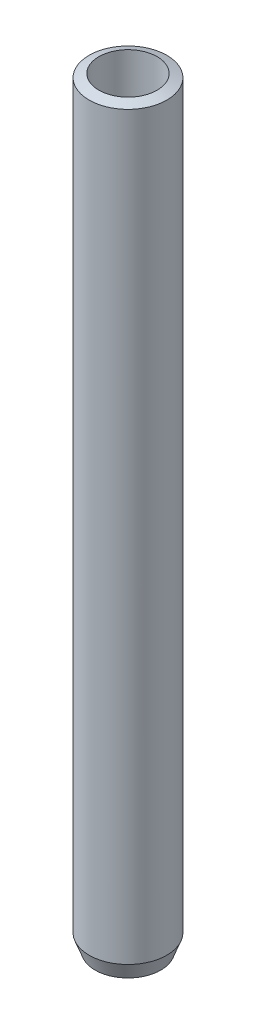
ISO-10303-21;
HEADER;
FILE_DESCRIPTION(('STEP AP214'),'2;1');
FILE_NAME('part.step','',(''),(''),'','','');
FILE_SCHEMA(('AUTOMOTIVE_DESIGN { 1 0 10303 214 1 1 1 1 }'));
ENDSEC;
DATA;
#1=APPLICATION_CONTEXT('core data for automotive mechanical design processes');
#2=APPLICATION_PROTOCOL_DEFINITION('international standard','automotive_design',2000,#1);
#3=PRODUCT_CONTEXT('',#1,'mechanical');
#4=PRODUCT('Part','Part','',(#3));
#5=PRODUCT_RELATED_PRODUCT_CATEGORY('part','',(#4));
#6=PRODUCT_DEFINITION_FORMATION('','',#4);
#7=PRODUCT_DEFINITION_CONTEXT('part definition',#1,'design');
#8=PRODUCT_DEFINITION('design','',#6,#7);
#9=PRODUCT_DEFINITION_SHAPE('','',#8);
#10=(LENGTH_UNIT() NAMED_UNIT(*) SI_UNIT(.MILLI.,.METRE.));
#11=(NAMED_UNIT(*) PLANE_ANGLE_UNIT() SI_UNIT($,.RADIAN.));
#12=(NAMED_UNIT(*) SI_UNIT($,.STERADIAN.) SOLID_ANGLE_UNIT());
#13=UNCERTAINTY_MEASURE_WITH_UNIT(LENGTH_MEASURE(1.E-05),#10,'distance_accuracy_value','');
#14=(GEOMETRIC_REPRESENTATION_CONTEXT(3) GLOBAL_UNCERTAINTY_ASSIGNED_CONTEXT((#13)) GLOBAL_UNIT_ASSIGNED_CONTEXT((#10,
#11,#12)) REPRESENTATION_CONTEXT('',''));
#15=CARTESIAN_POINT('',(0.,0.,0.));
#16=DIRECTION('',(0.,0.,1.));
#17=DIRECTION('',(1.,0.,0.));
#18=AXIS2_PLACEMENT_3D('',#15,#16,#17);
#19=CARTESIAN_POINT('',(0.,245.358295881277,0.));
#20=DIRECTION('',(0.,-1.,0.));
#21=DIRECTION('',(0.,0.,-1.));
#22=AXIS2_PLACEMENT_3D('',#19,#20,#21);
#23=CYLINDRICAL_SURFACE('',#22,12.5);
#24=CARTESIAN_POINT('',(0.,243.425317249622,0.));
#25=DIRECTION('',(0.,1.,0.));
#26=DIRECTION('',(0.,0.,1.));
#27=AXIS2_PLACEMENT_3D('',#24,#25,#26);
#28=CIRCLE('',#27,12.5);
#29=CARTESIAN_POINT('',(0.,243.425317249622,12.5));
#30=VERTEX_POINT('',#29);
#31=EDGE_CURVE('E50',#30,#30,#28,.F.);
#32=ORIENTED_EDGE('',*,*,#31,.T.);
#33=EDGE_LOOP('',(#32));
#34=FACE_BOUND('',#33,.T.);
#35=CARTESIAN_POINT('',(0.,5.12605785578657,0.));
#36=DIRECTION('',(0.,1.,0.));
#37=DIRECTION('',(0.,0.,1.));
#38=AXIS2_PLACEMENT_3D('',#35,#36,#37);
#39=CIRCLE('',#38,12.5);
#40=CARTESIAN_POINT('',(0.,5.12605785578657,12.5));
#41=VERTEX_POINT('',#40);
#42=EDGE_CURVE('E51',#41,#41,#39,.T.);
#43=ORIENTED_EDGE('',*,*,#42,.T.);
#44=EDGE_LOOP('',(#43));
#45=FACE_BOUND('',#44,.T.);
#46=ADVANCED_FACE('F39',(#34,#45),#23,.T.);
#47=CARTESIAN_POINT('',(0.,0.,0.));
#48=DIRECTION('',(0.,1.,0.));
#49=DIRECTION('',(0.,0.,1.));
#50=AXIS2_PLACEMENT_3D('',#47,#48,#49);
#51=PLANE('',#50);
#52=CARTESIAN_POINT('',(0.,0.,0.));
#53=DIRECTION('',(0.,1.,0.));
#54=DIRECTION('',(0.,0.,1.));
#55=AXIS2_PLACEMENT_3D('',#52,#53,#54);
#56=CIRCLE('',#55,10.5670213683447);
#57=CARTESIAN_POINT('',(0.,0.,10.5670213683447));
#58=VERTEX_POINT('',#57);
#59=EDGE_CURVE('E10',#58,#58,#56,.F.);
#60=ORIENTED_EDGE('',*,*,#59,.T.);
#61=EDGE_LOOP('',(#60));
#62=FACE_BOUND('',#61,.T.);
#63=CARTESIAN_POINT('',(0.,0.,0.));
#64=DIRECTION('',(0.,1.,0.));
#65=DIRECTION('',(0.,0.,1.));
#66=AXIS2_PLACEMENT_3D('',#63,#64,#65);
#67=CIRCLE('',#66,9.36560220599364);
#68=CARTESIAN_POINT('',(0.,0.,9.36560220599364));
#69=VERTEX_POINT('',#68);
#70=EDGE_CURVE('E58',#69,#69,#67,.T.);
#71=ORIENTED_EDGE('',*,*,#70,.T.);
#72=EDGE_LOOP('',(#71));
#73=FACE_BOUND('',#72,.T.);
#74=ADVANCED_FACE('F62',(#62,#73),#51,.F.);
#75=CARTESIAN_POINT('',(0.,245.358295881277,0.));
#76=DIRECTION('',(0.,-1.,0.));
#77=DIRECTION('',(0.,0.,-1.));
#78=AXIS2_PLACEMENT_3D('',#75,#76,#77);
#79=CYLINDRICAL_SURFACE('',#78,9.36560220599364);
#80=CARTESIAN_POINT('',(0.,244.607263323852,0.));
#81=DIRECTION('',(0.,-1.,0.));
#82=DIRECTION('',(0.,0.,-1.));
#83=AXIS2_PLACEMENT_3D('',#80,#81,#82);
#84=CIRCLE('',#83,9.36560220599364);
#85=CARTESIAN_POINT('',(0.,244.607263323852,-9.36560220599364));
#86=VERTEX_POINT('',#85);
#87=EDGE_CURVE('E54',#86,#86,#84,.F.);
#88=ORIENTED_EDGE('',*,*,#87,.T.);
#89=EDGE_LOOP('',(#88));
#90=FACE_BOUND('',#89,.T.);
#91=ORIENTED_EDGE('',*,*,#70,.F.);
#92=EDGE_LOOP('',(#91));
#93=FACE_BOUND('',#92,.T.);
#94=ADVANCED_FACE('F68',(#90,#93),#79,.F.);
#95=CARTESIAN_POINT('',(0.,245.358295881277,0.));
#96=DIRECTION('',(0.,-1.,0.));
#97=DIRECTION('',(0.,0.,-1.));
#98=AXIS2_PLACEMENT_3D('',#95,#96,#97);
#99=CONICAL_SURFACE('',#98,7.37394214421333,1.21019570244498);
#100=ORIENTED_EDGE('',*,*,#31,.F.);
#101=EDGE_LOOP('',(#100));
#102=FACE_BOUND('',#101,.T.);
#103=ORIENTED_EDGE('',*,*,#87,.F.);
#104=EDGE_LOOP('',(#103));
#105=FACE_BOUND('',#104,.T.);
#106=ADVANCED_FACE('F66',(#102,#105),#99,.T.);
#107=CARTESIAN_POINT('',(0.,5.12605785578657,0.));
#108=DIRECTION('',(0.,1.,0.));
#109=DIRECTION('',(0.,0.,1.));
#110=AXIS2_PLACEMENT_3D('',#107,#108,#109);
#111=CONICAL_SURFACE('',#110,12.5,0.360600624349926);
#112=ORIENTED_EDGE('',*,*,#59,.F.);
#113=EDGE_LOOP('',(#112));
#114=FACE_BOUND('',#113,.T.);
#115=ORIENTED_EDGE('',*,*,#42,.F.);
#116=EDGE_LOOP('',(#115));
#117=FACE_BOUND('',#116,.T.);
#118=ADVANCED_FACE('F45',(#114,#117),#111,.T.);
#119=CLOSED_SHELL('',(#46,#74,#94,#106,#118));
#120=MANIFOLD_SOLID_BREP('B2',#119);
#121=ADVANCED_BREP_SHAPE_REPRESENTATION('',(#18,#120),#14);
#122=SHAPE_DEFINITION_REPRESENTATION(#9,#121);
ENDSEC;
END-ISO-10303-21;
